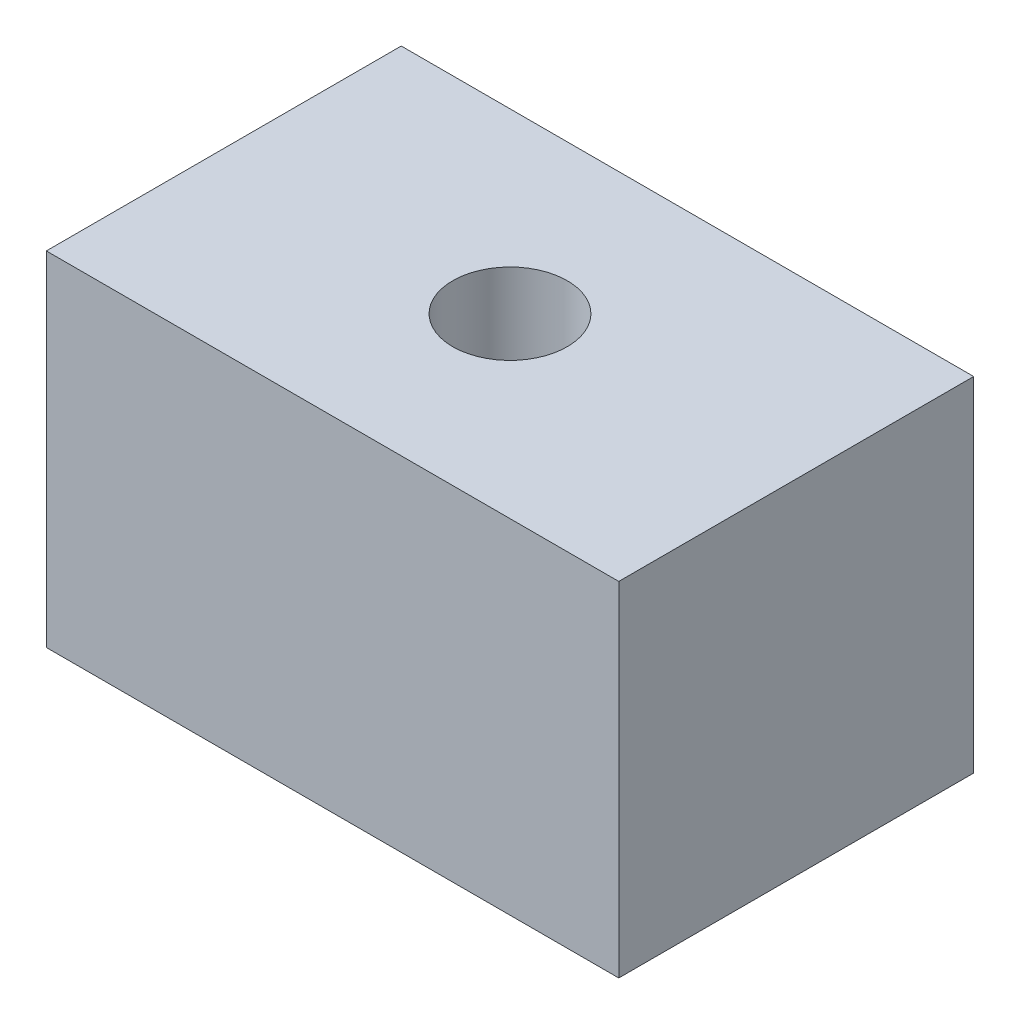
ISO-10303-21;
HEADER;
FILE_DESCRIPTION(('STEP AP214'),'2;1');
FILE_NAME('part.step','',(''),(''),'','','');
FILE_SCHEMA(('AUTOMOTIVE_DESIGN { 1 0 10303 214 1 1 1 1 }'));
ENDSEC;
DATA;
#1=APPLICATION_CONTEXT('core data for automotive mechanical design processes');
#2=APPLICATION_PROTOCOL_DEFINITION('international standard','automotive_design',2000,#1);
#3=PRODUCT_CONTEXT('',#1,'mechanical');
#4=PRODUCT('Part','Part','',(#3));
#5=PRODUCT_RELATED_PRODUCT_CATEGORY('part','',(#4));
#6=PRODUCT_DEFINITION_FORMATION('','',#4);
#7=PRODUCT_DEFINITION_CONTEXT('part definition',#1,'design');
#8=PRODUCT_DEFINITION('design','',#6,#7);
#9=PRODUCT_DEFINITION_SHAPE('','',#8);
#10=(LENGTH_UNIT() NAMED_UNIT(*) SI_UNIT(.MILLI.,.METRE.));
#11=(NAMED_UNIT(*) PLANE_ANGLE_UNIT() SI_UNIT($,.RADIAN.));
#12=(NAMED_UNIT(*) SI_UNIT($,.STERADIAN.) SOLID_ANGLE_UNIT());
#13=UNCERTAINTY_MEASURE_WITH_UNIT(LENGTH_MEASURE(1.E-05),#10,'distance_accuracy_value','');
#14=(GEOMETRIC_REPRESENTATION_CONTEXT(3) GLOBAL_UNCERTAINTY_ASSIGNED_CONTEXT((#13)) GLOBAL_UNIT_ASSIGNED_CONTEXT((#10,
#11,#12)) REPRESENTATION_CONTEXT('',''));
#15=CARTESIAN_POINT('',(0.,0.,0.));
#16=DIRECTION('',(0.,0.,1.));
#17=DIRECTION('',(1.,0.,0.));
#18=AXIS2_PLACEMENT_3D('',#15,#16,#17);
#19=CARTESIAN_POINT('',(12.5,15.,7.75));
#20=DIRECTION('',(-1.,0.,0.));
#21=DIRECTION('',(0.,0.,1.));
#22=AXIS2_PLACEMENT_3D('',#19,#20,#21);
#23=PLANE('',#22);
#24=DIRECTION('',(0.,0.,-1.));
#25=VECTOR('',#24,1.);
#26=CARTESIAN_POINT('',(12.5,0.,7.75));
#27=LINE('',#26,#25);
#28=CARTESIAN_POINT('',(12.5,0.,7.75));
#29=VERTEX_POINT('',#28);
#30=CARTESIAN_POINT('',(12.5,0.,-7.75));
#31=VERTEX_POINT('',#30);
#32=EDGE_CURVE('E107',#29,#31,#27,.T.);
#33=ORIENTED_EDGE('',*,*,#32,.T.);
#34=DIRECTION('',(0.,-1.,0.));
#35=VECTOR('',#34,1.);
#36=CARTESIAN_POINT('',(12.5,15.,-7.75));
#37=LINE('',#36,#35);
#38=CARTESIAN_POINT('',(12.5,15.,-7.75));
#39=VERTEX_POINT('',#38);
#40=EDGE_CURVE('E11',#39,#31,#37,.T.);
#41=ORIENTED_EDGE('',*,*,#40,.F.);
#42=DIRECTION('',(0.,0.,-1.));
#43=VECTOR('',#42,1.);
#44=CARTESIAN_POINT('',(12.5,15.,7.75));
#45=LINE('',#44,#43);
#46=CARTESIAN_POINT('',(12.5,15.,7.75));
#47=VERTEX_POINT('',#46);
#48=EDGE_CURVE('E91',#47,#39,#45,.T.);
#49=ORIENTED_EDGE('',*,*,#48,.F.);
#50=DIRECTION('',(0.,-1.,0.));
#51=VECTOR('',#50,1.);
#52=CARTESIAN_POINT('',(12.5,15.,7.75));
#53=LINE('',#52,#51);
#54=EDGE_CURVE('E103',#47,#29,#53,.T.);
#55=ORIENTED_EDGE('',*,*,#54,.T.);
#56=EDGE_LOOP('',(#33,#41,#49,#55));
#57=FACE_BOUND('',#56,.T.);
#58=ADVANCED_FACE('F39',(#57),#23,.F.);
#59=CARTESIAN_POINT('',(-12.5,15.,-7.75));
#60=DIRECTION('',(0.,0.,1.));
#61=DIRECTION('',(1.,0.,0.));
#62=AXIS2_PLACEMENT_3D('',#59,#60,#61);
#63=PLANE('',#62);
#64=DIRECTION('',(-1.,0.,0.));
#65=VECTOR('',#64,1.);
#66=CARTESIAN_POINT('',(-12.5,0.,-7.75));
#67=LINE('',#66,#65);
#68=CARTESIAN_POINT('',(-12.5,0.,-7.75));
#69=VERTEX_POINT('',#68);
#70=EDGE_CURVE('E96',#31,#69,#67,.T.);
#71=ORIENTED_EDGE('',*,*,#70,.T.);
#72=DIRECTION('',(0.,-1.,0.));
#73=VECTOR('',#72,1.);
#74=CARTESIAN_POINT('',(-12.5,15.,-7.75));
#75=LINE('',#74,#73);
#76=CARTESIAN_POINT('',(-12.5,15.,-7.75));
#77=VERTEX_POINT('',#76);
#78=EDGE_CURVE('E48',#77,#69,#75,.T.);
#79=ORIENTED_EDGE('',*,*,#78,.F.);
#80=DIRECTION('',(-1.,0.,0.));
#81=VECTOR('',#80,1.);
#82=CARTESIAN_POINT('',(-12.5,15.,-7.75));
#83=LINE('',#82,#81);
#84=EDGE_CURVE('E86',#39,#77,#83,.T.);
#85=ORIENTED_EDGE('',*,*,#84,.F.);
#86=ORIENTED_EDGE('',*,*,#40,.T.);
#87=EDGE_LOOP('',(#71,#79,#85,#86));
#88=FACE_BOUND('',#87,.T.);
#89=ADVANCED_FACE('F95',(#88),#63,.F.);
#90=CARTESIAN_POINT('',(-12.5,15.,7.75));
#91=DIRECTION('',(1.,0.,0.));
#92=DIRECTION('',(0.,0.,-1.));
#93=AXIS2_PLACEMENT_3D('',#90,#91,#92);
#94=PLANE('',#93);
#95=DIRECTION('',(0.,0.,1.));
#96=VECTOR('',#95,1.);
#97=CARTESIAN_POINT('',(-12.5,0.,7.75));
#98=LINE('',#97,#96);
#99=CARTESIAN_POINT('',(-12.5,0.,7.75));
#100=VERTEX_POINT('',#99);
#101=EDGE_CURVE('E73',#69,#100,#98,.T.);
#102=ORIENTED_EDGE('',*,*,#101,.T.);
#103=DIRECTION('',(0.,-1.,0.));
#104=VECTOR('',#103,1.);
#105=CARTESIAN_POINT('',(-12.5,15.,7.75));
#106=LINE('',#105,#104);
#107=CARTESIAN_POINT('',(-12.5,15.,7.75));
#108=VERTEX_POINT('',#107);
#109=EDGE_CURVE('E98',#108,#100,#106,.T.);
#110=ORIENTED_EDGE('',*,*,#109,.F.);
#111=DIRECTION('',(0.,0.,1.));
#112=VECTOR('',#111,1.);
#113=CARTESIAN_POINT('',(-12.5,15.,7.75));
#114=LINE('',#113,#112);
#115=EDGE_CURVE('E89',#77,#108,#114,.T.);
#116=ORIENTED_EDGE('',*,*,#115,.F.);
#117=ORIENTED_EDGE('',*,*,#78,.T.);
#118=EDGE_LOOP('',(#102,#110,#116,#117));
#119=FACE_BOUND('',#118,.T.);
#120=ADVANCED_FACE('F99',(#119),#94,.F.);
#121=CARTESIAN_POINT('',(-12.5,15.,7.75));
#122=DIRECTION('',(0.,0.,-1.));
#123=DIRECTION('',(-1.,0.,0.));
#124=AXIS2_PLACEMENT_3D('',#121,#122,#123);
#125=PLANE('',#124);
#126=DIRECTION('',(1.,0.,0.));
#127=VECTOR('',#126,1.);
#128=CARTESIAN_POINT('',(-12.5,0.,7.75));
#129=LINE('',#128,#127);
#130=EDGE_CURVE('E79',#100,#29,#129,.T.);
#131=ORIENTED_EDGE('',*,*,#130,.T.);
#132=ORIENTED_EDGE('',*,*,#54,.F.);
#133=DIRECTION('',(1.,0.,0.));
#134=VECTOR('',#133,1.);
#135=CARTESIAN_POINT('',(-12.5,15.,7.75));
#136=LINE('',#135,#134);
#137=EDGE_CURVE('E56',#108,#47,#136,.T.);
#138=ORIENTED_EDGE('',*,*,#137,.F.);
#139=ORIENTED_EDGE('',*,*,#109,.T.);
#140=EDGE_LOOP('',(#131,#132,#138,#139));
#141=FACE_BOUND('',#140,.T.);
#142=ADVANCED_FACE('F121',(#141),#125,.F.);
#143=CARTESIAN_POINT('',(0.,15.,0.));
#144=DIRECTION('',(0.,-1.,0.));
#145=DIRECTION('',(0.,0.,-1.));
#146=AXIS2_PLACEMENT_3D('',#143,#144,#145);
#147=PLANE('',#146);
#148=CARTESIAN_POINT('',(0.,15.,0.));
#149=DIRECTION('',(0.,1.,0.));
#150=DIRECTION('',(0.,0.,1.));
#151=AXIS2_PLACEMENT_3D('',#148,#149,#150);
#152=CIRCLE('',#151,2.5);
#153=CARTESIAN_POINT('',(0.,15.,2.5));
#154=VERTEX_POINT('',#153);
#155=EDGE_CURVE('E128',#154,#154,#152,.T.);
#156=ORIENTED_EDGE('',*,*,#155,.F.);
#157=EDGE_LOOP('',(#156));
#158=FACE_BOUND('',#157,.T.);
#159=ORIENTED_EDGE('',*,*,#48,.T.);
#160=ORIENTED_EDGE('',*,*,#84,.T.);
#161=ORIENTED_EDGE('',*,*,#115,.T.);
#162=ORIENTED_EDGE('',*,*,#137,.T.);
#163=EDGE_LOOP('',(#159,#160,#161,#162));
#164=FACE_BOUND('',#163,.T.);
#165=ADVANCED_FACE('F87',(#158,#164),#147,.F.);
#166=CARTESIAN_POINT('',(0.,0.,0.));
#167=DIRECTION('',(0.,-1.,0.));
#168=DIRECTION('',(0.,0.,-1.));
#169=AXIS2_PLACEMENT_3D('',#166,#167,#168);
#170=PLANE('',#169);
#171=CARTESIAN_POINT('',(-5.,0.,0.));
#172=DIRECTION('',(0.,-1.,0.));
#173=DIRECTION('',(0.,0.,-1.));
#174=AXIS2_PLACEMENT_3D('',#171,#172,#173);
#175=CIRCLE('',#174,2.5);
#176=CARTESIAN_POINT('',(-5.,0.,-2.5));
#177=VERTEX_POINT('',#176);
#178=EDGE_CURVE('E144',#177,#177,#175,.T.);
#179=ORIENTED_EDGE('',*,*,#178,.F.);
#180=EDGE_LOOP('',(#179));
#181=FACE_BOUND('',#180,.T.);
#182=CARTESIAN_POINT('',(5.,0.,0.));
#183=DIRECTION('',(0.,-1.,0.));
#184=DIRECTION('',(0.,0.,-1.));
#185=AXIS2_PLACEMENT_3D('',#182,#183,#184);
#186=CIRCLE('',#185,2.5);
#187=CARTESIAN_POINT('',(5.,0.,-2.5));
#188=VERTEX_POINT('',#187);
#189=EDGE_CURVE('E136',#188,#188,#186,.T.);
#190=ORIENTED_EDGE('',*,*,#189,.F.);
#191=EDGE_LOOP('',(#190));
#192=FACE_BOUND('',#191,.T.);
#193=ORIENTED_EDGE('',*,*,#32,.F.);
#194=ORIENTED_EDGE('',*,*,#130,.F.);
#195=ORIENTED_EDGE('',*,*,#101,.F.);
#196=ORIENTED_EDGE('',*,*,#70,.F.);
#197=EDGE_LOOP('',(#193,#194,#195,#196));
#198=FACE_BOUND('',#197,.T.);
#199=ADVANCED_FACE('F124',(#181,#192,#198),#170,.T.);
#200=CARTESIAN_POINT('',(0.,5.,0.));
#201=DIRECTION('',(0.,1.,0.));
#202=DIRECTION('',(0.,0.,1.));
#203=AXIS2_PLACEMENT_3D('',#200,#201,#202);
#204=CYLINDRICAL_SURFACE('',#203,2.5);
#205=CARTESIAN_POINT('',(0.,5.,0.));
#206=DIRECTION('',(0.,1.,0.));
#207=DIRECTION('',(0.,0.,1.));
#208=AXIS2_PLACEMENT_3D('',#205,#206,#207);
#209=CIRCLE('',#208,2.5);
#210=CARTESIAN_POINT('',(0.,5.,2.5));
#211=VERTEX_POINT('',#210);
#212=EDGE_CURVE('E111',#211,#211,#209,.T.);
#213=ORIENTED_EDGE('',*,*,#212,.F.);
#214=EDGE_LOOP('',(#213));
#215=FACE_BOUND('',#214,.T.);
#216=ORIENTED_EDGE('',*,*,#155,.T.);
#217=EDGE_LOOP('',(#216));
#218=FACE_BOUND('',#217,.T.);
#219=ADVANCED_FACE('F163',(#215,#218),#204,.F.);
#220=CARTESIAN_POINT('',(0.,5.,0.));
#221=DIRECTION('',(0.,1.,0.));
#222=DIRECTION('',(0.,0.,1.));
#223=AXIS2_PLACEMENT_3D('',#220,#221,#222);
#224=PLANE('',#223);
#225=ORIENTED_EDGE('',*,*,#212,.T.);
#226=EDGE_LOOP('',(#225));
#227=FACE_BOUND('',#226,.T.);
#228=ADVANCED_FACE('F169',(#227),#224,.T.);
#229=CARTESIAN_POINT('',(5.,4.,0.));
#230=DIRECTION('',(0.,-1.,0.));
#231=DIRECTION('',(0.,0.,-1.));
#232=AXIS2_PLACEMENT_3D('',#229,#230,#231);
#233=CYLINDRICAL_SURFACE('',#232,2.5);
#234=CARTESIAN_POINT('',(5.,4.,0.));
#235=DIRECTION('',(0.,-1.,0.));
#236=DIRECTION('',(0.,0.,-1.));
#237=AXIS2_PLACEMENT_3D('',#234,#235,#236);
#238=CIRCLE('',#237,2.5);
#239=CARTESIAN_POINT('',(5.,4.,-2.5));
#240=VERTEX_POINT('',#239);
#241=EDGE_CURVE('E132',#240,#240,#238,.T.);
#242=ORIENTED_EDGE('',*,*,#241,.F.);
#243=EDGE_LOOP('',(#242));
#244=FACE_BOUND('',#243,.T.);
#245=ORIENTED_EDGE('',*,*,#189,.T.);
#246=EDGE_LOOP('',(#245));
#247=FACE_BOUND('',#246,.T.);
#248=ADVANCED_FACE('F167',(#244,#247),#233,.F.);
#249=CARTESIAN_POINT('',(5.,4.,0.));
#250=DIRECTION('',(0.,-1.,0.));
#251=DIRECTION('',(0.,0.,-1.));
#252=AXIS2_PLACEMENT_3D('',#249,#250,#251);
#253=PLANE('',#252);
#254=ORIENTED_EDGE('',*,*,#241,.T.);
#255=EDGE_LOOP('',(#254));
#256=FACE_BOUND('',#255,.T.);
#257=ADVANCED_FACE('F157',(#256),#253,.T.);
#258=CARTESIAN_POINT('',(-5.,4.,0.));
#259=DIRECTION('',(0.,-1.,0.));
#260=DIRECTION('',(0.,0.,-1.));
#261=AXIS2_PLACEMENT_3D('',#258,#259,#260);
#262=CYLINDRICAL_SURFACE('',#261,2.5);
#263=CARTESIAN_POINT('',(-5.,4.,0.));
#264=DIRECTION('',(0.,-1.,0.));
#265=DIRECTION('',(0.,0.,-1.));
#266=AXIS2_PLACEMENT_3D('',#263,#264,#265);
#267=CIRCLE('',#266,2.5);
#268=CARTESIAN_POINT('',(-5.,4.,-2.5));
#269=VERTEX_POINT('',#268);
#270=EDGE_CURVE('E140',#269,#269,#267,.T.);
#271=ORIENTED_EDGE('',*,*,#270,.F.);
#272=EDGE_LOOP('',(#271));
#273=FACE_BOUND('',#272,.T.);
#274=ORIENTED_EDGE('',*,*,#178,.T.);
#275=EDGE_LOOP('',(#274));
#276=FACE_BOUND('',#275,.T.);
#277=ADVANCED_FACE('F154',(#273,#276),#262,.F.);
#278=CARTESIAN_POINT('',(-5.,4.,0.));
#279=DIRECTION('',(0.,-1.,0.));
#280=DIRECTION('',(0.,0.,-1.));
#281=AXIS2_PLACEMENT_3D('',#278,#279,#280);
#282=PLANE('',#281);
#283=ORIENTED_EDGE('',*,*,#270,.T.);
#284=EDGE_LOOP('',(#283));
#285=FACE_BOUND('',#284,.T.);
#286=ADVANCED_FACE('F152',(#285),#282,.T.);
#287=CLOSED_SHELL('',(#58,#89,#120,#142,#165,#199,#219,#228,#248,#257,#277,#286));
#288=MANIFOLD_SOLID_BREP('B2',#287);
#289=ADVANCED_BREP_SHAPE_REPRESENTATION('',(#18,#288),#14);
#290=SHAPE_DEFINITION_REPRESENTATION(#9,#289);
ENDSEC;
END-ISO-10303-21;
